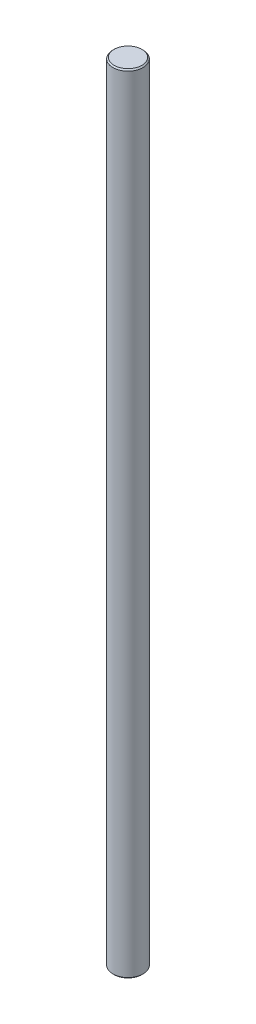
ISO-10303-21;
HEADER;
FILE_DESCRIPTION(('STEP AP214'),'2;1');
FILE_NAME('part.step','',(''),(''),'','','');
FILE_SCHEMA(('AUTOMOTIVE_DESIGN { 1 0 10303 214 1 1 1 1 }'));
ENDSEC;
DATA;
#1=APPLICATION_CONTEXT('core data for automotive mechanical design processes');
#2=APPLICATION_PROTOCOL_DEFINITION('international standard','automotive_design',2000,#1);
#3=PRODUCT_CONTEXT('',#1,'mechanical');
#4=PRODUCT('Part','Part','',(#3));
#5=PRODUCT_RELATED_PRODUCT_CATEGORY('part','',(#4));
#6=PRODUCT_DEFINITION_FORMATION('','',#4);
#7=PRODUCT_DEFINITION_CONTEXT('part definition',#1,'design');
#8=PRODUCT_DEFINITION('design','',#6,#7);
#9=PRODUCT_DEFINITION_SHAPE('','',#8);
#10=(LENGTH_UNIT() NAMED_UNIT(*) SI_UNIT(.MILLI.,.METRE.));
#11=(NAMED_UNIT(*) PLANE_ANGLE_UNIT() SI_UNIT($,.RADIAN.));
#12=(NAMED_UNIT(*) SI_UNIT($,.STERADIAN.) SOLID_ANGLE_UNIT());
#13=UNCERTAINTY_MEASURE_WITH_UNIT(LENGTH_MEASURE(1.E-05),#10,'distance_accuracy_value','');
#14=(GEOMETRIC_REPRESENTATION_CONTEXT(3) GLOBAL_UNCERTAINTY_ASSIGNED_CONTEXT((#13)) GLOBAL_UNIT_ASSIGNED_CONTEXT((#10,
#11,#12)) REPRESENTATION_CONTEXT('',''));
#15=CARTESIAN_POINT('',(0.,0.,0.));
#16=DIRECTION('',(0.,0.,1.));
#17=DIRECTION('',(1.,0.,0.));
#18=AXIS2_PLACEMENT_3D('',#15,#16,#17);
#19=CARTESIAN_POINT('',(0.,312.,0.));
#20=DIRECTION('',(0.,-1.,0.));
#21=DIRECTION('',(0.,0.,-1.));
#22=AXIS2_PLACEMENT_3D('',#19,#20,#21);
#23=CYLINDRICAL_SURFACE('',#22,6.);
#24=CARTESIAN_POINT('',(0.,311.5,0.));
#25=DIRECTION('',(0.,1.,0.));
#26=DIRECTION('',(0.,0.,1.));
#27=AXIS2_PLACEMENT_3D('',#24,#25,#26);
#28=CIRCLE('',#27,6.);
#29=CARTESIAN_POINT('',(0.,311.5,6.));
#30=VERTEX_POINT('',#29);
#31=EDGE_CURVE('E39',#30,#30,#28,.F.);
#32=ORIENTED_EDGE('',*,*,#31,.T.);
#33=EDGE_LOOP('',(#32));
#34=FACE_BOUND('',#33,.T.);
#35=CARTESIAN_POINT('',(0.,0.5,0.));
#36=DIRECTION('',(0.,1.,0.));
#37=DIRECTION('',(0.,0.,1.));
#38=AXIS2_PLACEMENT_3D('',#35,#36,#37);
#39=CIRCLE('',#38,6.);
#40=CARTESIAN_POINT('',(0.,0.5,6.));
#41=VERTEX_POINT('',#40);
#42=EDGE_CURVE('E43',#41,#41,#39,.T.);
#43=ORIENTED_EDGE('',*,*,#42,.T.);
#44=EDGE_LOOP('',(#43));
#45=FACE_BOUND('',#44,.T.);
#46=ADVANCED_FACE('F32',(#34,#45),#23,.T.);
#47=CARTESIAN_POINT('',(0.,312.,0.));
#48=DIRECTION('',(0.,1.,0.));
#49=DIRECTION('',(0.,0.,1.));
#50=AXIS2_PLACEMENT_3D('',#47,#48,#49);
#51=PLANE('',#50);
#52=CARTESIAN_POINT('',(0.,312.,0.));
#53=DIRECTION('',(0.,1.,0.));
#54=DIRECTION('',(0.,0.,1.));
#55=AXIS2_PLACEMENT_3D('',#52,#53,#54);
#56=CIRCLE('',#55,5.49999999999998);
#57=CARTESIAN_POINT('',(0.,312.,5.49999999999998));
#58=VERTEX_POINT('',#57);
#59=EDGE_CURVE('E47',#58,#58,#56,.T.);
#60=ORIENTED_EDGE('',*,*,#59,.T.);
#61=EDGE_LOOP('',(#60));
#62=FACE_BOUND('',#61,.T.);
#63=ADVANCED_FACE('F53',(#62),#51,.T.);
#64=CARTESIAN_POINT('',(0.,0.,0.));
#65=DIRECTION('',(0.,1.,0.));
#66=DIRECTION('',(0.,0.,1.));
#67=AXIS2_PLACEMENT_3D('',#64,#65,#66);
#68=PLANE('',#67);
#69=CARTESIAN_POINT('',(0.,0.,0.));
#70=DIRECTION('',(0.,1.,0.));
#71=DIRECTION('',(0.,0.,1.));
#72=AXIS2_PLACEMENT_3D('',#69,#70,#71);
#73=CIRCLE('',#72,5.50000000000001);
#74=CARTESIAN_POINT('',(0.,0.,5.50000000000001));
#75=VERTEX_POINT('',#74);
#76=EDGE_CURVE('E10',#75,#75,#73,.F.);
#77=ORIENTED_EDGE('',*,*,#76,.T.);
#78=EDGE_LOOP('',(#77));
#79=FACE_BOUND('',#78,.T.);
#80=ADVANCED_FACE('F57',(#79),#68,.F.);
#81=CARTESIAN_POINT('',(0.,312.,0.));
#82=DIRECTION('',(0.,-1.,0.));
#83=DIRECTION('',(0.,0.,-1.));
#84=AXIS2_PLACEMENT_3D('',#81,#82,#83);
#85=CONICAL_SURFACE('',#84,5.49999999999998,0.785398163397472);
#86=ORIENTED_EDGE('',*,*,#31,.F.);
#87=EDGE_LOOP('',(#86));
#88=FACE_BOUND('',#87,.T.);
#89=ORIENTED_EDGE('',*,*,#59,.F.);
#90=EDGE_LOOP('',(#89));
#91=FACE_BOUND('',#90,.T.);
#92=ADVANCED_FACE('F55',(#88,#91),#85,.T.);
#93=CARTESIAN_POINT('',(0.,0.5,0.));
#94=DIRECTION('',(0.,1.,0.));
#95=DIRECTION('',(0.,0.,1.));
#96=AXIS2_PLACEMENT_3D('',#93,#94,#95);
#97=CONICAL_SURFACE('',#96,6.,0.785398163397443);
#98=ORIENTED_EDGE('',*,*,#76,.F.);
#99=EDGE_LOOP('',(#98));
#100=FACE_BOUND('',#99,.T.);
#101=ORIENTED_EDGE('',*,*,#42,.F.);
#102=EDGE_LOOP('',(#101));
#103=FACE_BOUND('',#102,.T.);
#104=ADVANCED_FACE('F34',(#100,#103),#97,.T.);
#105=CLOSED_SHELL('',(#46,#63,#80,#92,#104));
#106=MANIFOLD_SOLID_BREP('B2',#105);
#107=ADVANCED_BREP_SHAPE_REPRESENTATION('',(#18,#106),#14);
#108=SHAPE_DEFINITION_REPRESENTATION(#9,#107);
ENDSEC;
END-ISO-10303-21;
